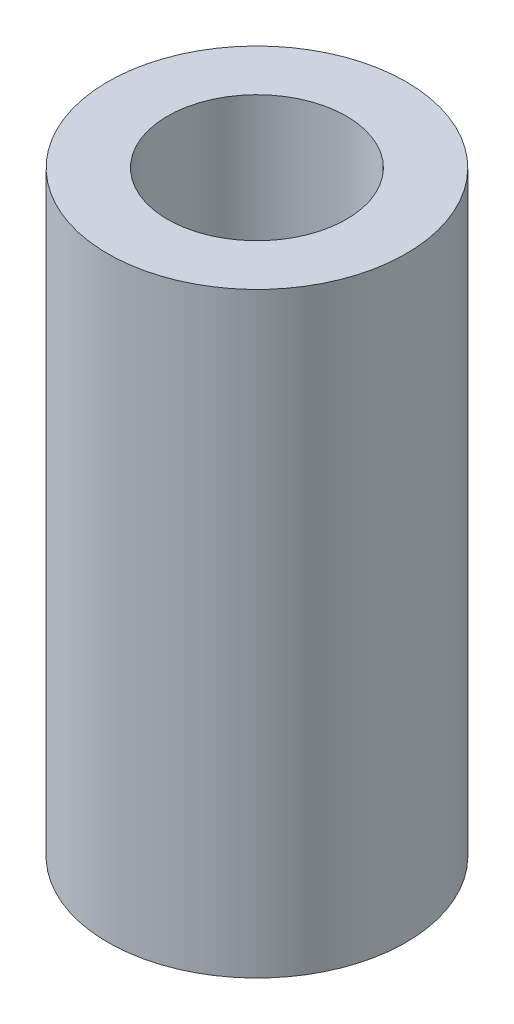
ISO-10303-21;
HEADER;
FILE_DESCRIPTION(('STEP AP214'),'2;1');
FILE_NAME('part.step','',(''),(''),'','','');
FILE_SCHEMA(('AUTOMOTIVE_DESIGN { 1 0 10303 214 1 1 1 1 }'));
ENDSEC;
DATA;
#1=APPLICATION_CONTEXT('core data for automotive mechanical design processes');
#2=APPLICATION_PROTOCOL_DEFINITION('international standard','automotive_design',2000,#1);
#3=PRODUCT_CONTEXT('',#1,'mechanical');
#4=PRODUCT('Part','Part','',(#3));
#5=PRODUCT_RELATED_PRODUCT_CATEGORY('part','',(#4));
#6=PRODUCT_DEFINITION_FORMATION('','',#4);
#7=PRODUCT_DEFINITION_CONTEXT('part definition',#1,'design');
#8=PRODUCT_DEFINITION('design','',#6,#7);
#9=PRODUCT_DEFINITION_SHAPE('','',#8);
#10=(LENGTH_UNIT() NAMED_UNIT(*) SI_UNIT(.MILLI.,.METRE.));
#11=(NAMED_UNIT(*) PLANE_ANGLE_UNIT() SI_UNIT($,.RADIAN.));
#12=(NAMED_UNIT(*) SI_UNIT($,.STERADIAN.) SOLID_ANGLE_UNIT());
#13=UNCERTAINTY_MEASURE_WITH_UNIT(LENGTH_MEASURE(1.E-05),#10,'distance_accuracy_value','');
#14=(GEOMETRIC_REPRESENTATION_CONTEXT(3) GLOBAL_UNCERTAINTY_ASSIGNED_CONTEXT((#13)) GLOBAL_UNIT_ASSIGNED_CONTEXT((#10,
#11,#12)) REPRESENTATION_CONTEXT('',''));
#15=CARTESIAN_POINT('',(0.,0.,0.));
#16=DIRECTION('',(0.,0.,1.));
#17=DIRECTION('',(1.,0.,0.));
#18=AXIS2_PLACEMENT_3D('',#15,#16,#17);
#19=CARTESIAN_POINT('',(0.,-2.,0.));
#20=DIRECTION('',(0.,-1.,0.));
#21=DIRECTION('',(0.,0.,-1.));
#22=AXIS2_PLACEMENT_3D('',#19,#20,#21);
#23=PLANE('',#22);
#24=CARTESIAN_POINT('',(5.00000000000001,-2.,0.));
#25=DIRECTION('',(0.,-1.,0.));
#26=DIRECTION('',(0.,0.,-1.));
#27=AXIS2_PLACEMENT_3D('',#24,#25,#26);
#28=CIRCLE('',#27,3.);
#29=CARTESIAN_POINT('',(5.00000000000001,-2.,-3.));
#30=VERTEX_POINT('',#29);
#31=EDGE_CURVE('E11',#30,#30,#28,.F.);
#32=ORIENTED_EDGE('',*,*,#31,.F.);
#33=EDGE_LOOP('',(#32));
#34=FACE_BOUND('',#33,.T.);
#35=CARTESIAN_POINT('',(5.00000000000001,-2.,0.));
#36=DIRECTION('',(0.,-1.,0.));
#37=DIRECTION('',(0.,0.,-1.));
#38=AXIS2_PLACEMENT_3D('',#35,#36,#37);
#39=CIRCLE('',#38,5.);
#40=CARTESIAN_POINT('',(5.00000000000001,-2.,-5.));
#41=VERTEX_POINT('',#40);
#42=EDGE_CURVE('E44',#41,#41,#39,.T.);
#43=ORIENTED_EDGE('',*,*,#42,.F.);
#44=EDGE_LOOP('',(#43));
#45=FACE_BOUND('',#44,.T.);
#46=ADVANCED_FACE('F34',(#34,#45),#23,.F.);
#47=CARTESIAN_POINT('',(0.,-20.,0.));
#48=DIRECTION('',(0.,-1.,0.));
#49=DIRECTION('',(0.,0.,-1.));
#50=AXIS2_PLACEMENT_3D('',#47,#48,#49);
#51=PLANE('',#50);
#52=CARTESIAN_POINT('',(5.00000000000001,-20.,0.));
#53=DIRECTION('',(0.,-1.,0.));
#54=DIRECTION('',(0.,0.,-1.));
#55=AXIS2_PLACEMENT_3D('',#52,#53,#54);
#56=CIRCLE('',#55,3.);
#57=CARTESIAN_POINT('',(5.00000000000001,-20.,-3.));
#58=VERTEX_POINT('',#57);
#59=EDGE_CURVE('E49',#58,#58,#56,.T.);
#60=ORIENTED_EDGE('',*,*,#59,.F.);
#61=EDGE_LOOP('',(#60));
#62=FACE_BOUND('',#61,.T.);
#63=ADVANCED_FACE('F56',(#62),#51,.F.);
#64=CARTESIAN_POINT('',(5.00000000000001,15.,0.));
#65=DIRECTION('',(0.,-1.,0.));
#66=DIRECTION('',(0.,0.,-1.));
#67=AXIS2_PLACEMENT_3D('',#64,#65,#66);
#68=CYLINDRICAL_SURFACE('',#67,3.);
#69=ORIENTED_EDGE('',*,*,#31,.T.);
#70=EDGE_LOOP('',(#69));
#71=FACE_BOUND('',#70,.T.);
#72=ORIENTED_EDGE('',*,*,#59,.T.);
#73=EDGE_LOOP('',(#72));
#74=FACE_BOUND('',#73,.T.);
#75=ADVANCED_FACE('F54',(#71,#74),#68,.F.);
#76=CARTESIAN_POINT('',(0.,-22.,0.));
#77=DIRECTION('',(0.,-1.,0.));
#78=DIRECTION('',(0.,0.,-1.));
#79=AXIS2_PLACEMENT_3D('',#76,#77,#78);
#80=PLANE('',#79);
#81=CARTESIAN_POINT('',(5.00000000000001,-22.,0.));
#82=DIRECTION('',(0.,-1.,0.));
#83=DIRECTION('',(0.,0.,-1.));
#84=AXIS2_PLACEMENT_3D('',#81,#82,#83);
#85=CIRCLE('',#84,5.);
#86=CARTESIAN_POINT('',(5.00000000000001,-22.,-5.));
#87=VERTEX_POINT('',#86);
#88=EDGE_CURVE('E40',#87,#87,#85,.T.);
#89=ORIENTED_EDGE('',*,*,#88,.T.);
#90=EDGE_LOOP('',(#89));
#91=FACE_BOUND('',#90,.T.);
#92=ADVANCED_FACE('F63',(#91),#80,.T.);
#93=CARTESIAN_POINT('',(5.00000000000001,-22.,0.));
#94=DIRECTION('',(0.,1.,0.));
#95=DIRECTION('',(0.,0.,1.));
#96=AXIS2_PLACEMENT_3D('',#93,#94,#95);
#97=CYLINDRICAL_SURFACE('',#96,5.);
#98=ORIENTED_EDGE('',*,*,#88,.F.);
#99=EDGE_LOOP('',(#98));
#100=FACE_BOUND('',#99,.T.);
#101=ORIENTED_EDGE('',*,*,#42,.T.);
#102=EDGE_LOOP('',(#101));
#103=FACE_BOUND('',#102,.T.);
#104=ADVANCED_FACE('F66',(#100,#103),#97,.T.);
#105=CLOSED_SHELL('',(#46,#63,#75,#92,#104));
#106=MANIFOLD_SOLID_BREP('B2',#105);
#107=ADVANCED_BREP_SHAPE_REPRESENTATION('',(#18,#106),#14);
#108=SHAPE_DEFINITION_REPRESENTATION(#9,#107);
ENDSEC;
END-ISO-10303-21;
